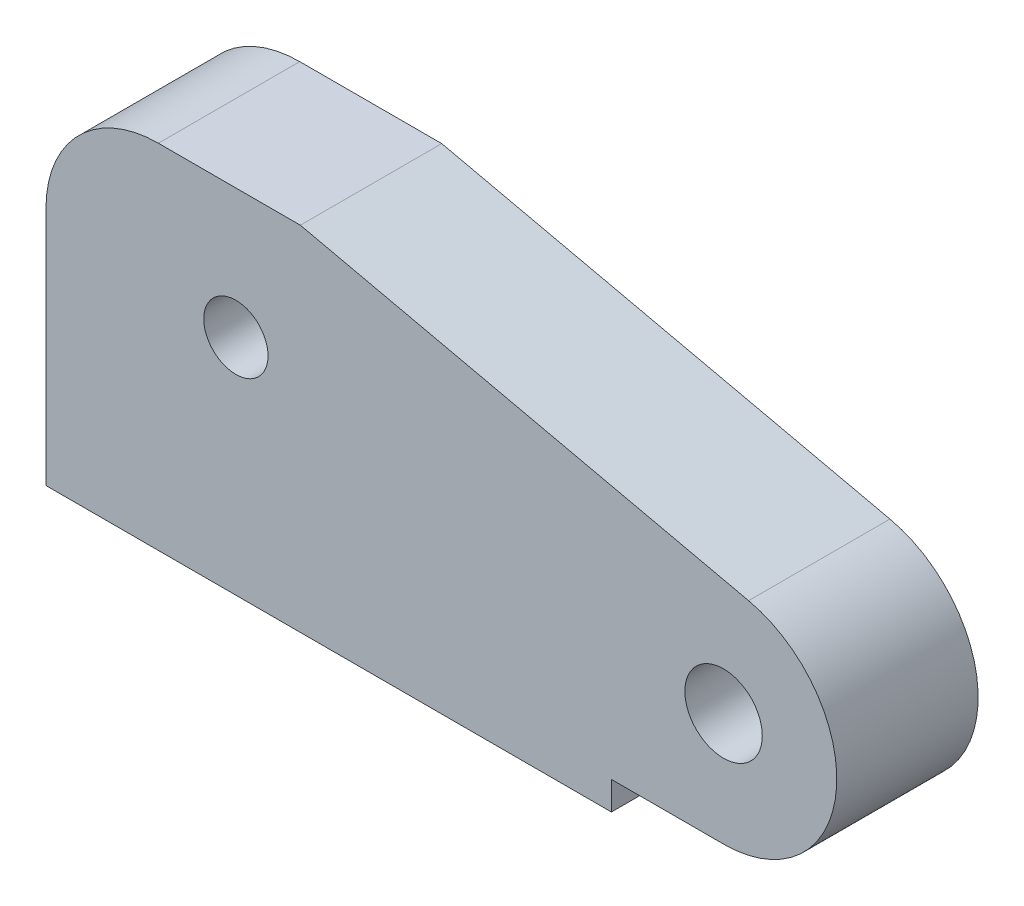
ISO-10303-21;
HEADER;
FILE_DESCRIPTION(('STEP AP214'),'2;1');
FILE_NAME('part.step','',(''),(''),'','','');
FILE_SCHEMA(('AUTOMOTIVE_DESIGN { 1 0 10303 214 1 1 1 1 }'));
ENDSEC;
DATA;
#1=APPLICATION_CONTEXT('core data for automotive mechanical design processes');
#2=APPLICATION_PROTOCOL_DEFINITION('international standard','automotive_design',2000,#1);
#3=PRODUCT_CONTEXT('',#1,'mechanical');
#4=PRODUCT('Part','Part','',(#3));
#5=PRODUCT_RELATED_PRODUCT_CATEGORY('part','',(#4));
#6=PRODUCT_DEFINITION_FORMATION('','',#4);
#7=PRODUCT_DEFINITION_CONTEXT('part definition',#1,'design');
#8=PRODUCT_DEFINITION('design','',#6,#7);
#9=PRODUCT_DEFINITION_SHAPE('','',#8);
#10=(LENGTH_UNIT() NAMED_UNIT(*) SI_UNIT(.MILLI.,.METRE.));
#11=(NAMED_UNIT(*) PLANE_ANGLE_UNIT() SI_UNIT($,.RADIAN.));
#12=(NAMED_UNIT(*) SI_UNIT($,.STERADIAN.) SOLID_ANGLE_UNIT());
#13=UNCERTAINTY_MEASURE_WITH_UNIT(LENGTH_MEASURE(1.E-05),#10,'distance_accuracy_value','');
#14=(GEOMETRIC_REPRESENTATION_CONTEXT(3) GLOBAL_UNCERTAINTY_ASSIGNED_CONTEXT((#13)) GLOBAL_UNIT_ASSIGNED_CONTEXT((#10,
#11,#12)) REPRESENTATION_CONTEXT('',''));
#15=CARTESIAN_POINT('',(0.,0.,0.));
#16=DIRECTION('',(0.,0.,1.));
#17=DIRECTION('',(1.,0.,0.));
#18=AXIS2_PLACEMENT_3D('',#15,#16,#17);
#19=CARTESIAN_POINT('',(-50.5497967215071,-16.5,10.));
#20=DIRECTION('',(0.,0.,-1.));
#21=DIRECTION('',(-1.,0.,0.));
#22=AXIS2_PLACEMENT_3D('',#19,#20,#21);
#23=PLANE('',#22);
#24=DIRECTION('',(1.,0.,0.));
#25=VECTOR('',#24,1.);
#26=CARTESIAN_POINT('',(-18.5,-33.5,10.));
#27=LINE('',#26,#25);
#28=CARTESIAN_POINT('',(-58.5,-33.5,10.));
#29=VERTEX_POINT('',#28);
#30=CARTESIAN_POINT('',(-18.5,-33.5,10.));
#31=VERTEX_POINT('',#30);
#32=EDGE_CURVE('E149',#29,#31,#27,.T.);
#33=ORIENTED_EDGE('',*,*,#32,.T.);
#34=DIRECTION('',(0.,1.,0.));
#35=VECTOR('',#34,1.);
#36=CARTESIAN_POINT('',(-18.5,-31.5,10.));
#37=LINE('',#36,#35);
#38=CARTESIAN_POINT('',(-18.5,-31.5,10.));
#39=VERTEX_POINT('',#38);
#40=EDGE_CURVE('E97',#31,#39,#37,.T.);
#41=ORIENTED_EDGE('',*,*,#40,.T.);
#42=DIRECTION('',(1.,0.,0.));
#43=VECTOR('',#42,1.);
#44=CARTESIAN_POINT('',(-10.567,-31.5,10.));
#45=LINE('',#44,#43);
#46=CARTESIAN_POINT('',(-10.567,-31.5,10.));
#47=VERTEX_POINT('',#46);
#48=EDGE_CURVE('E164',#39,#47,#45,.T.);
#49=ORIENTED_EDGE('',*,*,#48,.T.);
#50=CARTESIAN_POINT('',(-10.5547466050821,-23.5013736044339,10.));
#51=DIRECTION('',(0.,0.,1.));
#52=DIRECTION('',(-1.,0.,0.));
#53=AXIS2_PLACEMENT_3D('',#50,#51,#52);
#54=CIRCLE('',#53,7.99863578127753);
#55=CARTESIAN_POINT('',(-8.79566082133103,-15.6985669576601,10.));
#56=VERTEX_POINT('',#55);
#57=EDGE_CURVE('E177',#47,#56,#54,.T.);
#58=ORIENTED_EDGE('',*,*,#57,.T.);
#59=DIRECTION('',(-0.975517183197405,0.219923225891673,0.));
#60=VECTOR('',#59,1.);
#61=CARTESIAN_POINT('',(-40.505582207863,-8.54979672150709,10.));
#62=LINE('',#61,#60);
#63=CARTESIAN_POINT('',(-40.505582207863,-8.54979672150709,10.));
#64=VERTEX_POINT('',#63);
#65=EDGE_CURVE('E116',#56,#64,#62,.T.);
#66=ORIENTED_EDGE('',*,*,#65,.T.);
#67=DIRECTION('',(-1.,0.,0.));
#68=VECTOR('',#67,1.);
#69=CARTESIAN_POINT('',(-50.5497967215071,-8.54979672150709,10.));
#70=LINE('',#69,#68);
#71=CARTESIAN_POINT('',(-50.5497967215071,-8.54979672150709,10.));
#72=VERTEX_POINT('',#71);
#73=EDGE_CURVE('E110',#64,#72,#70,.T.);
#74=ORIENTED_EDGE('',*,*,#73,.T.);
#75=CARTESIAN_POINT('',(-50.5497967215071,-16.5,10.));
#76=DIRECTION('',(0.,0.,1.));
#77=DIRECTION('',(-1.,0.,0.));
#78=AXIS2_PLACEMENT_3D('',#75,#76,#77);
#79=CIRCLE('',#78,7.95020327849291);
#80=CARTESIAN_POINT('',(-58.5,-16.5,10.));
#81=VERTEX_POINT('',#80);
#82=EDGE_CURVE('E114',#72,#81,#79,.T.);
#83=ORIENTED_EDGE('',*,*,#82,.T.);
#84=DIRECTION('',(0.,-1.,0.));
#85=VECTOR('',#84,1.);
#86=CARTESIAN_POINT('',(-58.5,-33.5,10.));
#87=LINE('',#86,#85);
#88=EDGE_CURVE('E54',#81,#29,#87,.T.);
#89=ORIENTED_EDGE('',*,*,#88,.T.);
#90=EDGE_LOOP('',(#33,#41,#49,#58,#66,#74,#83,#89));
#91=FACE_BOUND('',#90,.T.);
#92=CARTESIAN_POINT('',(-45.067,-17.7,10.));
#93=DIRECTION('',(0.,0.,1.));
#94=DIRECTION('',(1.,0.,0.));
#95=AXIS2_PLACEMENT_3D('',#92,#93,#94);
#96=CIRCLE('',#95,2.2736408030161);
#97=CARTESIAN_POINT('',(-42.7933591969839,-17.7,10.));
#98=VERTEX_POINT('',#97);
#99=EDGE_CURVE('E138',#98,#98,#96,.T.);
#100=ORIENTED_EDGE('',*,*,#99,.F.);
#101=EDGE_LOOP('',(#100));
#102=FACE_BOUND('',#101,.T.);
#103=CARTESIAN_POINT('',(-10.567,-23.5,10.));
#104=DIRECTION('',(0.,0.,1.));
#105=DIRECTION('',(1.,0.,0.));
#106=AXIS2_PLACEMENT_3D('',#103,#104,#105);
#107=CIRCLE('',#106,2.73935448444314);
#108=CARTESIAN_POINT('',(-7.82764551555686,-23.5,10.));
#109=VERTEX_POINT('',#108);
#110=EDGE_CURVE('E186',#109,#109,#107,.T.);
#111=ORIENTED_EDGE('',*,*,#110,.F.);
#112=EDGE_LOOP('',(#111));
#113=FACE_BOUND('',#112,.T.);
#114=ADVANCED_FACE('F37',(#91,#102,#113),#23,.F.);
#115=CARTESIAN_POINT('',(-50.5497967215071,-16.5,0.));
#116=DIRECTION('',(0.,0.,-1.));
#117=DIRECTION('',(-1.,0.,0.));
#118=AXIS2_PLACEMENT_3D('',#115,#116,#117);
#119=PLANE('',#118);
#120=CARTESIAN_POINT('',(-45.067,-17.7,0.));
#121=DIRECTION('',(0.,0.,1.));
#122=DIRECTION('',(1.,0.,0.));
#123=AXIS2_PLACEMENT_3D('',#120,#121,#122);
#124=CIRCLE('',#123,2.2736408030161);
#125=CARTESIAN_POINT('',(-42.7933591969839,-17.7,0.));
#126=VERTEX_POINT('',#125);
#127=EDGE_CURVE('E183',#126,#126,#124,.T.);
#128=ORIENTED_EDGE('',*,*,#127,.T.);
#129=EDGE_LOOP('',(#128));
#130=FACE_BOUND('',#129,.T.);
#131=DIRECTION('',(1.,0.,0.));
#132=VECTOR('',#131,1.);
#133=CARTESIAN_POINT('',(-18.5,-33.5,0.));
#134=LINE('',#133,#132);
#135=CARTESIAN_POINT('',(-58.5,-33.5,0.));
#136=VERTEX_POINT('',#135);
#137=CARTESIAN_POINT('',(-18.5,-33.5,0.));
#138=VERTEX_POINT('',#137);
#139=EDGE_CURVE('E134',#136,#138,#134,.T.);
#140=ORIENTED_EDGE('',*,*,#139,.F.);
#141=DIRECTION('',(0.,-1.,0.));
#142=VECTOR('',#141,1.);
#143=CARTESIAN_POINT('',(-58.5,-33.5,0.));
#144=LINE('',#143,#142);
#145=CARTESIAN_POINT('',(-58.5,-16.5,0.));
#146=VERTEX_POINT('',#145);
#147=EDGE_CURVE('E89',#146,#136,#144,.T.);
#148=ORIENTED_EDGE('',*,*,#147,.F.);
#149=CARTESIAN_POINT('',(-50.5497967215071,-16.5,0.));
#150=DIRECTION('',(0.,0.,1.));
#151=DIRECTION('',(-1.,0.,0.));
#152=AXIS2_PLACEMENT_3D('',#149,#150,#151);
#153=CIRCLE('',#152,7.95020327849291);
#154=CARTESIAN_POINT('',(-50.5497967215071,-8.54979672150709,0.));
#155=VERTEX_POINT('',#154);
#156=EDGE_CURVE('E83',#155,#146,#153,.T.);
#157=ORIENTED_EDGE('',*,*,#156,.F.);
#158=DIRECTION('',(-1.,0.,0.));
#159=VECTOR('',#158,1.);
#160=CARTESIAN_POINT('',(-50.5497967215071,-8.54979672150709,0.));
#161=LINE('',#160,#159);
#162=CARTESIAN_POINT('',(-40.505582207863,-8.54979672150709,0.));
#163=VERTEX_POINT('',#162);
#164=EDGE_CURVE('E124',#163,#155,#161,.T.);
#165=ORIENTED_EDGE('',*,*,#164,.F.);
#166=DIRECTION('',(-0.975517183197405,0.219923225891673,0.));
#167=VECTOR('',#166,1.);
#168=CARTESIAN_POINT('',(-40.505582207863,-8.54979672150709,0.));
#169=LINE('',#168,#167);
#170=CARTESIAN_POINT('',(-8.79566082133103,-15.6985669576601,0.));
#171=VERTEX_POINT('',#170);
#172=EDGE_CURVE('E144',#171,#163,#169,.T.);
#173=ORIENTED_EDGE('',*,*,#172,.F.);
#174=CARTESIAN_POINT('',(-10.5547466050821,-23.5013736044339,0.));
#175=DIRECTION('',(0.,0.,1.));
#176=DIRECTION('',(-1.,0.,0.));
#177=AXIS2_PLACEMENT_3D('',#174,#175,#176);
#178=CIRCLE('',#177,7.99863578127753);
#179=CARTESIAN_POINT('',(-10.567,-31.5,0.));
#180=VERTEX_POINT('',#179);
#181=EDGE_CURVE('E142',#180,#171,#178,.T.);
#182=ORIENTED_EDGE('',*,*,#181,.F.);
#183=DIRECTION('',(1.,0.,0.));
#184=VECTOR('',#183,1.);
#185=CARTESIAN_POINT('',(-10.567,-31.5,0.));
#186=LINE('',#185,#184);
#187=CARTESIAN_POINT('',(-18.5,-31.5,0.));
#188=VERTEX_POINT('',#187);
#189=EDGE_CURVE('E140',#188,#180,#186,.T.);
#190=ORIENTED_EDGE('',*,*,#189,.F.);
#191=DIRECTION('',(0.,1.,0.));
#192=VECTOR('',#191,1.);
#193=CARTESIAN_POINT('',(-18.5,-31.5,0.));
#194=LINE('',#193,#192);
#195=EDGE_CURVE('E137',#138,#188,#194,.T.);
#196=ORIENTED_EDGE('',*,*,#195,.F.);
#197=EDGE_LOOP('',(#140,#148,#157,#165,#173,#182,#190,#196));
#198=FACE_BOUND('',#197,.T.);
#199=CARTESIAN_POINT('',(-10.567,-23.5,0.));
#200=DIRECTION('',(0.,0.,1.));
#201=DIRECTION('',(1.,0.,0.));
#202=AXIS2_PLACEMENT_3D('',#199,#200,#201);
#203=CIRCLE('',#202,2.73935448444314);
#204=CARTESIAN_POINT('',(-7.82764551555686,-23.5,0.));
#205=VERTEX_POINT('',#204);
#206=EDGE_CURVE('E189',#205,#205,#203,.T.);
#207=ORIENTED_EDGE('',*,*,#206,.T.);
#208=EDGE_LOOP('',(#207));
#209=FACE_BOUND('',#208,.T.);
#210=ADVANCED_FACE('F168',(#130,#198,#209),#119,.T.);
#211=CARTESIAN_POINT('',(-18.5,-33.5,10.));
#212=DIRECTION('',(0.,1.,0.));
#213=DIRECTION('',(0.,0.,1.));
#214=AXIS2_PLACEMENT_3D('',#211,#212,#213);
#215=PLANE('',#214);
#216=ORIENTED_EDGE('',*,*,#139,.T.);
#217=DIRECTION('',(0.,0.,-1.));
#218=VECTOR('',#217,1.);
#219=CARTESIAN_POINT('',(-18.5,-33.5,10.));
#220=LINE('',#219,#218);
#221=EDGE_CURVE('E11',#31,#138,#220,.T.);
#222=ORIENTED_EDGE('',*,*,#221,.F.);
#223=ORIENTED_EDGE('',*,*,#32,.F.);
#224=DIRECTION('',(0.,0.,-1.));
#225=VECTOR('',#224,1.);
#226=CARTESIAN_POINT('',(-58.5,-33.5,10.));
#227=LINE('',#226,#225);
#228=EDGE_CURVE('E130',#29,#136,#227,.T.);
#229=ORIENTED_EDGE('',*,*,#228,.T.);
#230=EDGE_LOOP('',(#216,#222,#223,#229));
#231=FACE_BOUND('',#230,.T.);
#232=ADVANCED_FACE('F39',(#231),#215,.F.);
#233=CARTESIAN_POINT('',(-18.5,-31.5,10.));
#234=DIRECTION('',(-1.,0.,0.));
#235=DIRECTION('',(0.,0.,1.));
#236=AXIS2_PLACEMENT_3D('',#233,#234,#235);
#237=PLANE('',#236);
#238=ORIENTED_EDGE('',*,*,#195,.T.);
#239=DIRECTION('',(0.,0.,-1.));
#240=VECTOR('',#239,1.);
#241=CARTESIAN_POINT('',(-18.5,-31.5,10.));
#242=LINE('',#241,#240);
#243=EDGE_CURVE('E46',#39,#188,#242,.T.);
#244=ORIENTED_EDGE('',*,*,#243,.F.);
#245=ORIENTED_EDGE('',*,*,#40,.F.);
#246=ORIENTED_EDGE('',*,*,#221,.T.);
#247=EDGE_LOOP('',(#238,#244,#245,#246));
#248=FACE_BOUND('',#247,.T.);
#249=ADVANCED_FACE('F221',(#248),#237,.F.);
#250=CARTESIAN_POINT('',(-10.567,-31.5,10.));
#251=DIRECTION('',(0.,1.,0.));
#252=DIRECTION('',(0.,0.,1.));
#253=AXIS2_PLACEMENT_3D('',#250,#251,#252);
#254=PLANE('',#253);
#255=ORIENTED_EDGE('',*,*,#189,.T.);
#256=DIRECTION('',(0.,0.,-1.));
#257=VECTOR('',#256,1.);
#258=CARTESIAN_POINT('',(-10.567,-31.5,10.));
#259=LINE('',#258,#257);
#260=EDGE_CURVE('E156',#47,#180,#259,.T.);
#261=ORIENTED_EDGE('',*,*,#260,.F.);
#262=ORIENTED_EDGE('',*,*,#48,.F.);
#263=ORIENTED_EDGE('',*,*,#243,.T.);
#264=EDGE_LOOP('',(#255,#261,#262,#263));
#265=FACE_BOUND('',#264,.T.);
#266=ADVANCED_FACE('F162',(#265),#254,.F.);
#267=CARTESIAN_POINT('',(-10.5547466050821,-23.5013736044339,10.));
#268=DIRECTION('',(0.,0.,-1.));
#269=DIRECTION('',(-1.,0.,0.));
#270=AXIS2_PLACEMENT_3D('',#267,#268,#269);
#271=CYLINDRICAL_SURFACE('',#270,7.99863578127753);
#272=ORIENTED_EDGE('',*,*,#181,.T.);
#273=DIRECTION('',(0.,0.,-1.));
#274=VECTOR('',#273,1.);
#275=CARTESIAN_POINT('',(-8.79566082133103,-15.6985669576601,10.));
#276=LINE('',#275,#274);
#277=EDGE_CURVE('E153',#56,#171,#276,.T.);
#278=ORIENTED_EDGE('',*,*,#277,.F.);
#279=ORIENTED_EDGE('',*,*,#57,.F.);
#280=ORIENTED_EDGE('',*,*,#260,.T.);
#281=EDGE_LOOP('',(#272,#278,#279,#280));
#282=FACE_BOUND('',#281,.T.);
#283=ADVANCED_FACE('F173',(#282),#271,.T.);
#284=CARTESIAN_POINT('',(-40.505582207863,-8.54979672150709,10.));
#285=DIRECTION('',(-0.219923225891673,-0.975517183197406,0.));
#286=DIRECTION('',(0.975517183197406,-0.219923225891673,0.));
#287=AXIS2_PLACEMENT_3D('',#284,#285,#286);
#288=PLANE('',#287);
#289=ORIENTED_EDGE('',*,*,#172,.T.);
#290=DIRECTION('',(0.,0.,-1.));
#291=VECTOR('',#290,1.);
#292=CARTESIAN_POINT('',(-40.505582207863,-8.54979672150709,10.));
#293=LINE('',#292,#291);
#294=EDGE_CURVE('E125',#64,#163,#293,.T.);
#295=ORIENTED_EDGE('',*,*,#294,.F.);
#296=ORIENTED_EDGE('',*,*,#65,.F.);
#297=ORIENTED_EDGE('',*,*,#277,.T.);
#298=EDGE_LOOP('',(#289,#295,#296,#297));
#299=FACE_BOUND('',#298,.T.);
#300=ADVANCED_FACE('F176',(#299),#288,.F.);
#301=CARTESIAN_POINT('',(-50.5497967215071,-8.54979672150709,10.));
#302=DIRECTION('',(0.,-1.,0.));
#303=DIRECTION('',(0.,0.,-1.));
#304=AXIS2_PLACEMENT_3D('',#301,#302,#303);
#305=PLANE('',#304);
#306=ORIENTED_EDGE('',*,*,#164,.T.);
#307=DIRECTION('',(0.,0.,-1.));
#308=VECTOR('',#307,1.);
#309=CARTESIAN_POINT('',(-50.5497967215071,-8.54979672150709,10.));
#310=LINE('',#309,#308);
#311=EDGE_CURVE('E121',#72,#155,#310,.T.);
#312=ORIENTED_EDGE('',*,*,#311,.F.);
#313=ORIENTED_EDGE('',*,*,#73,.F.);
#314=ORIENTED_EDGE('',*,*,#294,.T.);
#315=EDGE_LOOP('',(#306,#312,#313,#314));
#316=FACE_BOUND('',#315,.T.);
#317=ADVANCED_FACE('F122',(#316),#305,.F.);
#318=CARTESIAN_POINT('',(-50.5497967215071,-16.5,10.));
#319=DIRECTION('',(0.,0.,-1.));
#320=DIRECTION('',(-1.,0.,0.));
#321=AXIS2_PLACEMENT_3D('',#318,#319,#320);
#322=CYLINDRICAL_SURFACE('',#321,7.95020327849291);
#323=ORIENTED_EDGE('',*,*,#156,.T.);
#324=DIRECTION('',(0.,0.,-1.));
#325=VECTOR('',#324,1.);
#326=CARTESIAN_POINT('',(-58.5,-16.5,10.));
#327=LINE('',#326,#325);
#328=EDGE_CURVE('E126',#81,#146,#327,.T.);
#329=ORIENTED_EDGE('',*,*,#328,.F.);
#330=ORIENTED_EDGE('',*,*,#82,.F.);
#331=ORIENTED_EDGE('',*,*,#311,.T.);
#332=EDGE_LOOP('',(#323,#329,#330,#331));
#333=FACE_BOUND('',#332,.T.);
#334=ADVANCED_FACE('F128',(#333),#322,.T.);
#335=CARTESIAN_POINT('',(-58.5,-33.5,10.));
#336=DIRECTION('',(1.,0.,0.));
#337=DIRECTION('',(0.,0.,-1.));
#338=AXIS2_PLACEMENT_3D('',#335,#336,#337);
#339=PLANE('',#338);
#340=ORIENTED_EDGE('',*,*,#147,.T.);
#341=ORIENTED_EDGE('',*,*,#228,.F.);
#342=ORIENTED_EDGE('',*,*,#88,.F.);
#343=ORIENTED_EDGE('',*,*,#328,.T.);
#344=EDGE_LOOP('',(#340,#341,#342,#343));
#345=FACE_BOUND('',#344,.T.);
#346=ADVANCED_FACE('F209',(#345),#339,.F.);
#347=CARTESIAN_POINT('',(-45.067,-17.7,10.));
#348=DIRECTION('',(0.,0.,-1.));
#349=DIRECTION('',(-1.,0.,0.));
#350=AXIS2_PLACEMENT_3D('',#347,#348,#349);
#351=CYLINDRICAL_SURFACE('',#350,2.2736408030161);
#352=ORIENTED_EDGE('',*,*,#99,.T.);
#353=EDGE_LOOP('',(#352));
#354=FACE_BOUND('',#353,.T.);
#355=ORIENTED_EDGE('',*,*,#127,.F.);
#356=EDGE_LOOP('',(#355));
#357=FACE_BOUND('',#356,.T.);
#358=ADVANCED_FACE('F206',(#354,#357),#351,.F.);
#359=CARTESIAN_POINT('',(-10.567,-23.5,10.));
#360=DIRECTION('',(0.,0.,-1.));
#361=DIRECTION('',(-1.,0.,0.));
#362=AXIS2_PLACEMENT_3D('',#359,#360,#361);
#363=CYLINDRICAL_SURFACE('',#362,2.73935448444314);
#364=ORIENTED_EDGE('',*,*,#110,.T.);
#365=EDGE_LOOP('',(#364));
#366=FACE_BOUND('',#365,.T.);
#367=ORIENTED_EDGE('',*,*,#206,.F.);
#368=EDGE_LOOP('',(#367));
#369=FACE_BOUND('',#368,.T.);
#370=ADVANCED_FACE('F195',(#366,#369),#363,.F.);
#371=CLOSED_SHELL('',(#114,#210,#232,#249,#266,#283,#300,#317,#334,#346,#358,#370));
#372=MANIFOLD_SOLID_BREP('B2',#371);
#373=ADVANCED_BREP_SHAPE_REPRESENTATION('',(#18,#372),#14);
#374=SHAPE_DEFINITION_REPRESENTATION(#9,#373);
ENDSEC;
END-ISO-10303-21;
